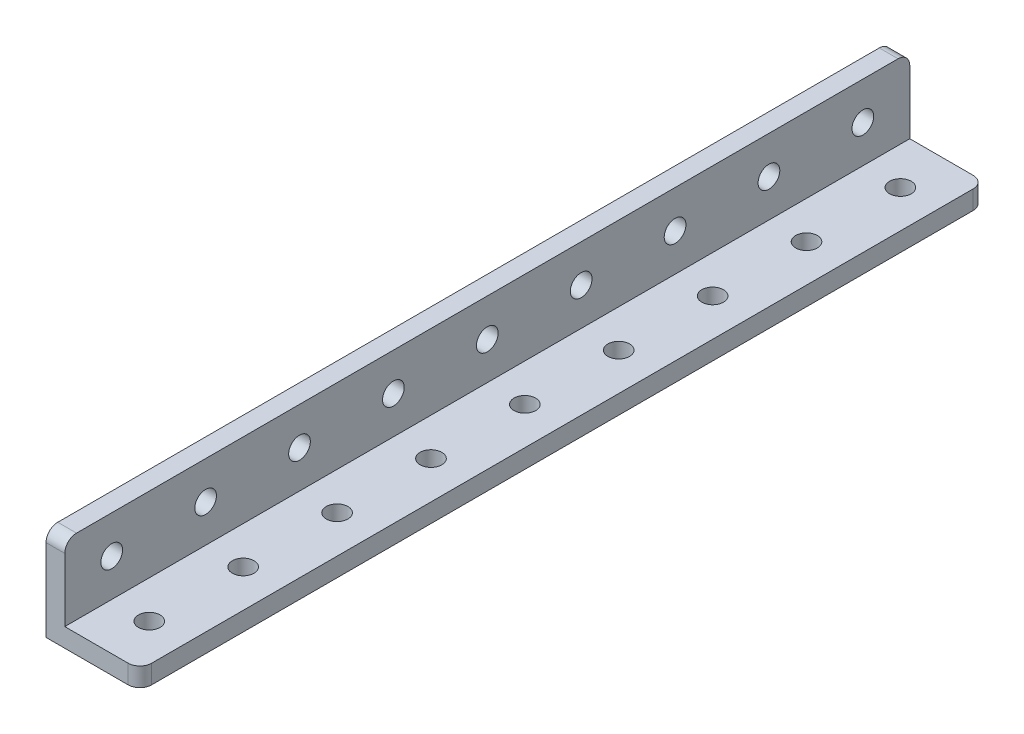
ISO-10303-21;
HEADER;
FILE_DESCRIPTION(('STEP AP214'),'2;1');
FILE_NAME('part.step','',(''),(''),'','','');
FILE_SCHEMA(('AUTOMOTIVE_DESIGN { 1 0 10303 214 1 1 1 1 }'));
ENDSEC;
DATA;
#1=APPLICATION_CONTEXT('core data for automotive mechanical design processes');
#2=APPLICATION_PROTOCOL_DEFINITION('international standard','automotive_design',2000,#1);
#3=PRODUCT_CONTEXT('',#1,'mechanical');
#4=PRODUCT('Part','Part','',(#3));
#5=PRODUCT_RELATED_PRODUCT_CATEGORY('part','',(#4));
#6=PRODUCT_DEFINITION_FORMATION('','',#4);
#7=PRODUCT_DEFINITION_CONTEXT('part definition',#1,'design');
#8=PRODUCT_DEFINITION('design','',#6,#7);
#9=PRODUCT_DEFINITION_SHAPE('','',#8);
#10=(LENGTH_UNIT() NAMED_UNIT(*) SI_UNIT(.MILLI.,.METRE.));
#11=(NAMED_UNIT(*) PLANE_ANGLE_UNIT() SI_UNIT($,.RADIAN.));
#12=(NAMED_UNIT(*) SI_UNIT($,.STERADIAN.) SOLID_ANGLE_UNIT());
#13=UNCERTAINTY_MEASURE_WITH_UNIT(LENGTH_MEASURE(1.E-05),#10,'distance_accuracy_value','');
#14=(GEOMETRIC_REPRESENTATION_CONTEXT(3) GLOBAL_UNCERTAINTY_ASSIGNED_CONTEXT((#13)) GLOBAL_UNIT_ASSIGNED_CONTEXT((#10,
#11,#12)) REPRESENTATION_CONTEXT('',''));
#15=CARTESIAN_POINT('',(0.,0.,0.));
#16=DIRECTION('',(0.,0.,1.));
#17=DIRECTION('',(1.,0.,0.));
#18=AXIS2_PLACEMENT_3D('',#15,#16,#17);
#19=CARTESIAN_POINT('',(14.,36.8576,-142.));
#20=DIRECTION('',(0.,-1.,0.));
#21=DIRECTION('',(0.,0.,-1.));
#22=AXIS2_PLACEMENT_3D('',#19,#20,#21);
#23=CYLINDRICAL_SURFACE('',#22,2.);
#24=CARTESIAN_POINT('',(14.,3.2,-142.));
#25=DIRECTION('',(0.,-1.,0.));
#26=DIRECTION('',(0.,0.,-1.));
#27=AXIS2_PLACEMENT_3D('',#24,#25,#26);
#28=CIRCLE('',#27,2.);
#29=CARTESIAN_POINT('',(16.,3.2,-142.));
#30=VERTEX_POINT('',#29);
#31=CARTESIAN_POINT('',(14.,3.2,-144.));
#32=VERTEX_POINT('',#31);
#33=EDGE_CURVE('E18',#30,#32,#28,.F.);
#34=ORIENTED_EDGE('',*,*,#33,.F.);
#35=DIRECTION('',(0.,1.,0.));
#36=VECTOR('',#35,1.);
#37=CARTESIAN_POINT('',(16.,0.,-142.));
#38=LINE('',#37,#36);
#39=CARTESIAN_POINT('',(16.,0.,-142.));
#40=VERTEX_POINT('',#39);
#41=EDGE_CURVE('E83',#40,#30,#38,.T.);
#42=ORIENTED_EDGE('',*,*,#41,.F.);
#43=CARTESIAN_POINT('',(14.,0.,-142.));
#44=DIRECTION('',(0.,-1.,0.));
#45=DIRECTION('',(0.,0.,-1.));
#46=AXIS2_PLACEMENT_3D('',#43,#44,#45);
#47=CIRCLE('',#46,2.);
#48=CARTESIAN_POINT('',(14.,0.,-144.));
#49=VERTEX_POINT('',#48);
#50=EDGE_CURVE('E224',#49,#40,#47,.T.);
#51=ORIENTED_EDGE('',*,*,#50,.F.);
#52=DIRECTION('',(0.,1.,0.));
#53=VECTOR('',#52,1.);
#54=CARTESIAN_POINT('',(14.,0.,-144.));
#55=LINE('',#54,#53);
#56=EDGE_CURVE('E86',#49,#32,#55,.T.);
#57=ORIENTED_EDGE('',*,*,#56,.T.);
#58=EDGE_LOOP('',(#34,#42,#51,#57));
#59=FACE_BOUND('',#58,.T.);
#60=ADVANCED_FACE('F15',(#59),#23,.T.);
#61=CARTESIAN_POINT('',(16.,0.,0.));
#62=DIRECTION('',(1.,0.,0.));
#63=DIRECTION('',(0.,0.,-1.));
#64=AXIS2_PLACEMENT_3D('',#61,#62,#63);
#65=PLANE('',#64);
#66=DIRECTION('',(0.,1.,0.));
#67=VECTOR('',#66,1.);
#68=CARTESIAN_POINT('',(16.,-20.8576,-2.));
#69=LINE('',#68,#67);
#70=CARTESIAN_POINT('',(16.,0.,-2.));
#71=VERTEX_POINT('',#70);
#72=CARTESIAN_POINT('',(16.,3.2,-2.));
#73=VERTEX_POINT('',#72);
#74=EDGE_CURVE('E92',#71,#73,#69,.T.);
#75=ORIENTED_EDGE('',*,*,#74,.F.);
#76=DIRECTION('',(0.,0.,-1.));
#77=VECTOR('',#76,1.);
#78=CARTESIAN_POINT('',(16.,0.,0.));
#79=LINE('',#78,#77);
#80=EDGE_CURVE('E99',#40,#71,#79,.F.);
#81=ORIENTED_EDGE('',*,*,#80,.F.);
#82=ORIENTED_EDGE('',*,*,#41,.T.);
#83=DIRECTION('',(0.,0.,1.));
#84=VECTOR('',#83,1.);
#85=CARTESIAN_POINT('',(16.,3.2,0.));
#86=LINE('',#85,#84);
#87=EDGE_CURVE('E96',#73,#30,#86,.F.);
#88=ORIENTED_EDGE('',*,*,#87,.F.);
#89=EDGE_LOOP('',(#75,#81,#82,#88));
#90=FACE_BOUND('',#89,.T.);
#91=ADVANCED_FACE('F95',(#90),#65,.T.);
#92=CARTESIAN_POINT('',(9.6,3.2,-8.));
#93=DIRECTION('',(0.,-1.,0.));
#94=DIRECTION('',(0.,0.,-1.));
#95=AXIS2_PLACEMENT_3D('',#92,#93,#94);
#96=CYLINDRICAL_SURFACE('',#95,1.85);
#97=CARTESIAN_POINT('',(9.6,3.2,-8.));
#98=DIRECTION('',(0.,-1.,0.));
#99=DIRECTION('',(0.,0.,-1.));
#100=AXIS2_PLACEMENT_3D('',#97,#98,#99);
#101=CIRCLE('',#100,1.85);
#102=CARTESIAN_POINT('',(9.6,3.2,-9.85));
#103=VERTEX_POINT('',#102);
#104=EDGE_CURVE('E104',#103,#103,#101,.T.);
#105=ORIENTED_EDGE('',*,*,#104,.F.);
#106=EDGE_LOOP('',(#105));
#107=FACE_BOUND('',#106,.T.);
#108=CARTESIAN_POINT('',(9.6,0.,-8.));
#109=DIRECTION('',(0.,-1.,0.));
#110=DIRECTION('',(0.,0.,-1.));
#111=AXIS2_PLACEMENT_3D('',#108,#109,#110);
#112=CIRCLE('',#111,1.85);
#113=CARTESIAN_POINT('',(9.6,0.,-9.85));
#114=VERTEX_POINT('',#113);
#115=EDGE_CURVE('E218',#114,#114,#112,.F.);
#116=ORIENTED_EDGE('',*,*,#115,.F.);
#117=EDGE_LOOP('',(#116));
#118=FACE_BOUND('',#117,.T.);
#119=ADVANCED_FACE('F259',(#107,#118),#96,.F.);
#120=CARTESIAN_POINT('',(9.6,3.2,-24.));
#121=DIRECTION('',(0.,-1.,0.));
#122=DIRECTION('',(0.,0.,-1.));
#123=AXIS2_PLACEMENT_3D('',#120,#121,#122);
#124=CYLINDRICAL_SURFACE('',#123,1.85);
#125=CARTESIAN_POINT('',(9.6,3.2,-24.));
#126=DIRECTION('',(0.,-1.,0.));
#127=DIRECTION('',(0.,0.,-1.));
#128=AXIS2_PLACEMENT_3D('',#125,#126,#127);
#129=CIRCLE('',#128,1.85);
#130=CARTESIAN_POINT('',(9.6,3.2,-25.85));
#131=VERTEX_POINT('',#130);
#132=EDGE_CURVE('E107',#131,#131,#129,.T.);
#133=ORIENTED_EDGE('',*,*,#132,.F.);
#134=EDGE_LOOP('',(#133));
#135=FACE_BOUND('',#134,.T.);
#136=CARTESIAN_POINT('',(9.6,0.,-24.));
#137=DIRECTION('',(0.,-1.,0.));
#138=DIRECTION('',(0.,0.,-1.));
#139=AXIS2_PLACEMENT_3D('',#136,#137,#138);
#140=CIRCLE('',#139,1.85);
#141=CARTESIAN_POINT('',(9.6,0.,-25.85));
#142=VERTEX_POINT('',#141);
#143=EDGE_CURVE('E215',#142,#142,#140,.F.);
#144=ORIENTED_EDGE('',*,*,#143,.F.);
#145=EDGE_LOOP('',(#144));
#146=FACE_BOUND('',#145,.T.);
#147=ADVANCED_FACE('F255',(#135,#146),#124,.F.);
#148=CARTESIAN_POINT('',(9.6,3.2,-40.));
#149=DIRECTION('',(0.,-1.,0.));
#150=DIRECTION('',(0.,0.,-1.));
#151=AXIS2_PLACEMENT_3D('',#148,#149,#150);
#152=CYLINDRICAL_SURFACE('',#151,1.85);
#153=CARTESIAN_POINT('',(9.6,3.2,-40.));
#154=DIRECTION('',(0.,-1.,0.));
#155=DIRECTION('',(0.,0.,-1.));
#156=AXIS2_PLACEMENT_3D('',#153,#154,#155);
#157=CIRCLE('',#156,1.85);
#158=CARTESIAN_POINT('',(9.6,3.2,-41.85));
#159=VERTEX_POINT('',#158);
#160=EDGE_CURVE('E247',#159,#159,#157,.T.);
#161=ORIENTED_EDGE('',*,*,#160,.F.);
#162=EDGE_LOOP('',(#161));
#163=FACE_BOUND('',#162,.T.);
#164=CARTESIAN_POINT('',(9.6,0.,-40.));
#165=DIRECTION('',(0.,-1.,0.));
#166=DIRECTION('',(0.,0.,-1.));
#167=AXIS2_PLACEMENT_3D('',#164,#165,#166);
#168=CIRCLE('',#167,1.85);
#169=CARTESIAN_POINT('',(9.6,0.,-41.85));
#170=VERTEX_POINT('',#169);
#171=EDGE_CURVE('E212',#170,#170,#168,.F.);
#172=ORIENTED_EDGE('',*,*,#171,.F.);
#173=EDGE_LOOP('',(#172));
#174=FACE_BOUND('',#173,.T.);
#175=ADVANCED_FACE('F258',(#163,#174),#152,.F.);
#176=CARTESIAN_POINT('',(9.6,3.2,-56.));
#177=DIRECTION('',(0.,-1.,0.));
#178=DIRECTION('',(0.,0.,-1.));
#179=AXIS2_PLACEMENT_3D('',#176,#177,#178);
#180=CYLINDRICAL_SURFACE('',#179,1.85);
#181=CARTESIAN_POINT('',(9.6,3.2,-56.));
#182=DIRECTION('',(0.,-1.,0.));
#183=DIRECTION('',(0.,0.,-1.));
#184=AXIS2_PLACEMENT_3D('',#181,#182,#183);
#185=CIRCLE('',#184,1.85);
#186=CARTESIAN_POINT('',(9.6,3.2,-57.85));
#187=VERTEX_POINT('',#186);
#188=EDGE_CURVE('E244',#187,#187,#185,.T.);
#189=ORIENTED_EDGE('',*,*,#188,.F.);
#190=EDGE_LOOP('',(#189));
#191=FACE_BOUND('',#190,.T.);
#192=CARTESIAN_POINT('',(9.6,0.,-56.));
#193=DIRECTION('',(0.,-1.,0.));
#194=DIRECTION('',(0.,0.,-1.));
#195=AXIS2_PLACEMENT_3D('',#192,#193,#194);
#196=CIRCLE('',#195,1.85);
#197=CARTESIAN_POINT('',(9.6,0.,-57.85));
#198=VERTEX_POINT('',#197);
#199=EDGE_CURVE('E209',#198,#198,#196,.F.);
#200=ORIENTED_EDGE('',*,*,#199,.F.);
#201=EDGE_LOOP('',(#200));
#202=FACE_BOUND('',#201,.T.);
#203=ADVANCED_FACE('F561',(#191,#202),#180,.F.);
#204=CARTESIAN_POINT('',(9.6,3.2,-72.));
#205=DIRECTION('',(0.,-1.,0.));
#206=DIRECTION('',(0.,0.,-1.));
#207=AXIS2_PLACEMENT_3D('',#204,#205,#206);
#208=CYLINDRICAL_SURFACE('',#207,1.85);
#209=CARTESIAN_POINT('',(9.6,3.2,-72.));
#210=DIRECTION('',(0.,-1.,0.));
#211=DIRECTION('',(0.,0.,-1.));
#212=AXIS2_PLACEMENT_3D('',#209,#210,#211);
#213=CIRCLE('',#212,1.85);
#214=CARTESIAN_POINT('',(9.6,3.2,-73.85));
#215=VERTEX_POINT('',#214);
#216=EDGE_CURVE('E241',#215,#215,#213,.T.);
#217=ORIENTED_EDGE('',*,*,#216,.F.);
#218=EDGE_LOOP('',(#217));
#219=FACE_BOUND('',#218,.T.);
#220=CARTESIAN_POINT('',(9.6,0.,-72.));
#221=DIRECTION('',(0.,-1.,0.));
#222=DIRECTION('',(0.,0.,-1.));
#223=AXIS2_PLACEMENT_3D('',#220,#221,#222);
#224=CIRCLE('',#223,1.85);
#225=CARTESIAN_POINT('',(9.6,0.,-73.85));
#226=VERTEX_POINT('',#225);
#227=EDGE_CURVE('E206',#226,#226,#224,.F.);
#228=ORIENTED_EDGE('',*,*,#227,.F.);
#229=EDGE_LOOP('',(#228));
#230=FACE_BOUND('',#229,.T.);
#231=ADVANCED_FACE('F552',(#219,#230),#208,.F.);
#232=CARTESIAN_POINT('',(9.6,3.2,-88.));
#233=DIRECTION('',(0.,-1.,0.));
#234=DIRECTION('',(0.,0.,-1.));
#235=AXIS2_PLACEMENT_3D('',#232,#233,#234);
#236=CYLINDRICAL_SURFACE('',#235,1.85);
#237=CARTESIAN_POINT('',(9.6,3.2,-88.));
#238=DIRECTION('',(0.,-1.,0.));
#239=DIRECTION('',(0.,0.,-1.));
#240=AXIS2_PLACEMENT_3D('',#237,#238,#239);
#241=CIRCLE('',#240,1.85);
#242=CARTESIAN_POINT('',(9.6,3.2,-89.85));
#243=VERTEX_POINT('',#242);
#244=EDGE_CURVE('E238',#243,#243,#241,.T.);
#245=ORIENTED_EDGE('',*,*,#244,.F.);
#246=EDGE_LOOP('',(#245));
#247=FACE_BOUND('',#246,.T.);
#248=CARTESIAN_POINT('',(9.6,0.,-88.));
#249=DIRECTION('',(0.,-1.,0.));
#250=DIRECTION('',(0.,0.,-1.));
#251=AXIS2_PLACEMENT_3D('',#248,#249,#250);
#252=CIRCLE('',#251,1.85);
#253=CARTESIAN_POINT('',(9.6,0.,-89.85));
#254=VERTEX_POINT('',#253);
#255=EDGE_CURVE('E203',#254,#254,#252,.F.);
#256=ORIENTED_EDGE('',*,*,#255,.F.);
#257=EDGE_LOOP('',(#256));
#258=FACE_BOUND('',#257,.T.);
#259=ADVANCED_FACE('F543',(#247,#258),#236,.F.);
#260=CARTESIAN_POINT('',(9.6,3.2,-104.));
#261=DIRECTION('',(0.,-1.,0.));
#262=DIRECTION('',(0.,0.,-1.));
#263=AXIS2_PLACEMENT_3D('',#260,#261,#262);
#264=CYLINDRICAL_SURFACE('',#263,1.85);
#265=CARTESIAN_POINT('',(9.6,3.2,-104.));
#266=DIRECTION('',(0.,-1.,0.));
#267=DIRECTION('',(0.,0.,-1.));
#268=AXIS2_PLACEMENT_3D('',#265,#266,#267);
#269=CIRCLE('',#268,1.85);
#270=CARTESIAN_POINT('',(9.6,3.2,-105.85));
#271=VERTEX_POINT('',#270);
#272=EDGE_CURVE('E235',#271,#271,#269,.T.);
#273=ORIENTED_EDGE('',*,*,#272,.F.);
#274=EDGE_LOOP('',(#273));
#275=FACE_BOUND('',#274,.T.);
#276=CARTESIAN_POINT('',(9.6,0.,-104.));
#277=DIRECTION('',(0.,-1.,0.));
#278=DIRECTION('',(0.,0.,-1.));
#279=AXIS2_PLACEMENT_3D('',#276,#277,#278);
#280=CIRCLE('',#279,1.85);
#281=CARTESIAN_POINT('',(9.6,0.,-105.85));
#282=VERTEX_POINT('',#281);
#283=EDGE_CURVE('E200',#282,#282,#280,.F.);
#284=ORIENTED_EDGE('',*,*,#283,.F.);
#285=EDGE_LOOP('',(#284));
#286=FACE_BOUND('',#285,.T.);
#287=ADVANCED_FACE('F534',(#275,#286),#264,.F.);
#288=CARTESIAN_POINT('',(9.6,3.2,-120.));
#289=DIRECTION('',(0.,-1.,0.));
#290=DIRECTION('',(0.,0.,-1.));
#291=AXIS2_PLACEMENT_3D('',#288,#289,#290);
#292=CYLINDRICAL_SURFACE('',#291,1.85);
#293=CARTESIAN_POINT('',(9.6,3.2,-120.));
#294=DIRECTION('',(0.,-1.,0.));
#295=DIRECTION('',(0.,0.,-1.));
#296=AXIS2_PLACEMENT_3D('',#293,#294,#295);
#297=CIRCLE('',#296,1.85);
#298=CARTESIAN_POINT('',(9.6,3.2,-121.85));
#299=VERTEX_POINT('',#298);
#300=EDGE_CURVE('E232',#299,#299,#297,.T.);
#301=ORIENTED_EDGE('',*,*,#300,.F.);
#302=EDGE_LOOP('',(#301));
#303=FACE_BOUND('',#302,.T.);
#304=CARTESIAN_POINT('',(9.6,0.,-120.));
#305=DIRECTION('',(0.,-1.,0.));
#306=DIRECTION('',(0.,0.,-1.));
#307=AXIS2_PLACEMENT_3D('',#304,#305,#306);
#308=CIRCLE('',#307,1.85);
#309=CARTESIAN_POINT('',(9.6,0.,-121.85));
#310=VERTEX_POINT('',#309);
#311=EDGE_CURVE('E197',#310,#310,#308,.F.);
#312=ORIENTED_EDGE('',*,*,#311,.F.);
#313=EDGE_LOOP('',(#312));
#314=FACE_BOUND('',#313,.T.);
#315=ADVANCED_FACE('F525',(#303,#314),#292,.F.);
#316=CARTESIAN_POINT('',(9.6,3.2,-136.));
#317=DIRECTION('',(0.,-1.,0.));
#318=DIRECTION('',(0.,0.,-1.));
#319=AXIS2_PLACEMENT_3D('',#316,#317,#318);
#320=CYLINDRICAL_SURFACE('',#319,1.85);
#321=CARTESIAN_POINT('',(9.6,3.2,-136.));
#322=DIRECTION('',(0.,-1.,0.));
#323=DIRECTION('',(0.,0.,-1.));
#324=AXIS2_PLACEMENT_3D('',#321,#322,#323);
#325=CIRCLE('',#324,1.85);
#326=CARTESIAN_POINT('',(9.6,3.2,-137.85));
#327=VERTEX_POINT('',#326);
#328=EDGE_CURVE('E229',#327,#327,#325,.T.);
#329=ORIENTED_EDGE('',*,*,#328,.F.);
#330=EDGE_LOOP('',(#329));
#331=FACE_BOUND('',#330,.T.);
#332=CARTESIAN_POINT('',(9.6,0.,-136.));
#333=DIRECTION('',(0.,-1.,0.));
#334=DIRECTION('',(0.,0.,-1.));
#335=AXIS2_PLACEMENT_3D('',#332,#333,#334);
#336=CIRCLE('',#335,1.85);
#337=CARTESIAN_POINT('',(9.6,0.,-137.85));
#338=VERTEX_POINT('',#337);
#339=EDGE_CURVE('E194',#338,#338,#336,.F.);
#340=ORIENTED_EDGE('',*,*,#339,.F.);
#341=EDGE_LOOP('',(#340));
#342=FACE_BOUND('',#341,.T.);
#343=ADVANCED_FACE('F516',(#331,#342),#320,.F.);
#344=CARTESIAN_POINT('',(14.,-20.8576,-2.));
#345=DIRECTION('',(0.,1.,0.));
#346=DIRECTION('',(0.,0.,1.));
#347=AXIS2_PLACEMENT_3D('',#344,#345,#346);
#348=CYLINDRICAL_SURFACE('',#347,2.);
#349=CARTESIAN_POINT('',(14.,0.,-2.));
#350=DIRECTION('',(0.,1.,0.));
#351=DIRECTION('',(0.,0.,1.));
#352=AXIS2_PLACEMENT_3D('',#349,#350,#351);
#353=CIRCLE('',#352,2.);
#354=CARTESIAN_POINT('',(14.,0.,0.));
#355=VERTEX_POINT('',#354);
#356=EDGE_CURVE('E222',#71,#355,#353,.F.);
#357=ORIENTED_EDGE('',*,*,#356,.F.);
#358=ORIENTED_EDGE('',*,*,#74,.T.);
#359=CARTESIAN_POINT('',(14.,3.2,-2.));
#360=DIRECTION('',(0.,1.,0.));
#361=DIRECTION('',(0.,0.,1.));
#362=AXIS2_PLACEMENT_3D('',#359,#360,#361);
#363=CIRCLE('',#362,2.);
#364=CARTESIAN_POINT('',(14.,3.2,0.));
#365=VERTEX_POINT('',#364);
#366=EDGE_CURVE('E91',#365,#73,#363,.T.);
#367=ORIENTED_EDGE('',*,*,#366,.F.);
#368=DIRECTION('',(0.,1.,0.));
#369=VECTOR('',#368,1.);
#370=CARTESIAN_POINT('',(14.,0.,0.));
#371=LINE('',#370,#369);
#372=EDGE_CURVE('E113',#355,#365,#371,.T.);
#373=ORIENTED_EDGE('',*,*,#372,.F.);
#374=EDGE_LOOP('',(#357,#358,#367,#373));
#375=FACE_BOUND('',#374,.T.);
#376=ADVANCED_FACE('F507',(#375),#348,.T.);
#377=CARTESIAN_POINT('',(16.,3.2,0.));
#378=DIRECTION('',(0.,1.,0.));
#379=DIRECTION('',(0.,0.,1.));
#380=AXIS2_PLACEMENT_3D('',#377,#378,#379);
#381=PLANE('',#380);
#382=ORIENTED_EDGE('',*,*,#328,.T.);
#383=EDGE_LOOP('',(#382));
#384=FACE_BOUND('',#383,.T.);
#385=ORIENTED_EDGE('',*,*,#300,.T.);
#386=EDGE_LOOP('',(#385));
#387=FACE_BOUND('',#386,.T.);
#388=ORIENTED_EDGE('',*,*,#272,.T.);
#389=EDGE_LOOP('',(#388));
#390=FACE_BOUND('',#389,.T.);
#391=ORIENTED_EDGE('',*,*,#244,.T.);
#392=EDGE_LOOP('',(#391));
#393=FACE_BOUND('',#392,.T.);
#394=ORIENTED_EDGE('',*,*,#216,.T.);
#395=EDGE_LOOP('',(#394));
#396=FACE_BOUND('',#395,.T.);
#397=ORIENTED_EDGE('',*,*,#188,.T.);
#398=EDGE_LOOP('',(#397));
#399=FACE_BOUND('',#398,.T.);
#400=ORIENTED_EDGE('',*,*,#160,.T.);
#401=EDGE_LOOP('',(#400));
#402=FACE_BOUND('',#401,.T.);
#403=ORIENTED_EDGE('',*,*,#132,.T.);
#404=EDGE_LOOP('',(#403));
#405=FACE_BOUND('',#404,.T.);
#406=ORIENTED_EDGE('',*,*,#104,.T.);
#407=EDGE_LOOP('',(#406));
#408=FACE_BOUND('',#407,.T.);
#409=ORIENTED_EDGE('',*,*,#366,.T.);
#410=ORIENTED_EDGE('',*,*,#87,.T.);
#411=ORIENTED_EDGE('',*,*,#33,.T.);
#412=DIRECTION('',(1.,0.,0.));
#413=VECTOR('',#412,1.);
#414=CARTESIAN_POINT('',(0.,3.2,-144.));
#415=LINE('',#414,#413);
#416=CARTESIAN_POINT('',(3.2,3.2,-144.));
#417=VERTEX_POINT('',#416);
#418=EDGE_CURVE('E119',#32,#417,#415,.F.);
#419=ORIENTED_EDGE('',*,*,#418,.T.);
#420=DIRECTION('',(0.,0.,-1.));
#421=VECTOR('',#420,1.);
#422=CARTESIAN_POINT('',(3.2,3.2,0.));
#423=LINE('',#422,#421);
#424=CARTESIAN_POINT('',(3.2,3.2,0.));
#425=VERTEX_POINT('',#424);
#426=EDGE_CURVE('E228',#425,#417,#423,.T.);
#427=ORIENTED_EDGE('',*,*,#426,.F.);
#428=DIRECTION('',(1.,0.,0.));
#429=VECTOR('',#428,1.);
#430=CARTESIAN_POINT('',(0.,3.2,0.));
#431=LINE('',#430,#429);
#432=EDGE_CURVE('E116',#365,#425,#431,.F.);
#433=ORIENTED_EDGE('',*,*,#432,.F.);
#434=EDGE_LOOP('',(#409,#410,#411,#419,#427,#433));
#435=FACE_BOUND('',#434,.T.);
#436=ADVANCED_FACE('F102',(#384,#387,#390,#393,#396,#399,#402,#405,#408,#435),#381,.T.);
#437=CARTESIAN_POINT('',(3.2,3.2,0.));
#438=DIRECTION('',(1.,0.,0.));
#439=DIRECTION('',(0.,0.,-1.));
#440=AXIS2_PLACEMENT_3D('',#437,#438,#439);
#441=PLANE('',#440);
#442=CARTESIAN_POINT('',(3.2,9.6,-136.));
#443=DIRECTION('',(-1.,0.,0.));
#444=DIRECTION('',(0.,0.,1.));
#445=AXIS2_PLACEMENT_3D('',#442,#443,#444);
#446=CIRCLE('',#445,1.85);
#447=CARTESIAN_POINT('',(3.2,9.6,-134.15));
#448=VERTEX_POINT('',#447);
#449=EDGE_CURVE('E162',#448,#448,#446,.T.);
#450=ORIENTED_EDGE('',*,*,#449,.T.);
#451=EDGE_LOOP('',(#450));
#452=FACE_BOUND('',#451,.T.);
#453=CARTESIAN_POINT('',(3.2,9.6,-120.));
#454=DIRECTION('',(-1.,0.,0.));
#455=DIRECTION('',(0.,0.,1.));
#456=AXIS2_PLACEMENT_3D('',#453,#454,#455);
#457=CIRCLE('',#456,1.85);
#458=CARTESIAN_POINT('',(3.2,9.6,-118.15));
#459=VERTEX_POINT('',#458);
#460=EDGE_CURVE('E165',#459,#459,#457,.T.);
#461=ORIENTED_EDGE('',*,*,#460,.T.);
#462=EDGE_LOOP('',(#461));
#463=FACE_BOUND('',#462,.T.);
#464=CARTESIAN_POINT('',(3.2,9.6,-104.));
#465=DIRECTION('',(-1.,0.,0.));
#466=DIRECTION('',(0.,0.,1.));
#467=AXIS2_PLACEMENT_3D('',#464,#465,#466);
#468=CIRCLE('',#467,1.85);
#469=CARTESIAN_POINT('',(3.2,9.6,-102.15));
#470=VERTEX_POINT('',#469);
#471=EDGE_CURVE('E168',#470,#470,#468,.T.);
#472=ORIENTED_EDGE('',*,*,#471,.T.);
#473=EDGE_LOOP('',(#472));
#474=FACE_BOUND('',#473,.T.);
#475=CARTESIAN_POINT('',(3.2,9.6,-88.));
#476=DIRECTION('',(-1.,0.,0.));
#477=DIRECTION('',(0.,0.,1.));
#478=AXIS2_PLACEMENT_3D('',#475,#476,#477);
#479=CIRCLE('',#478,1.85);
#480=CARTESIAN_POINT('',(3.2,9.6,-86.15));
#481=VERTEX_POINT('',#480);
#482=EDGE_CURVE('E171',#481,#481,#479,.T.);
#483=ORIENTED_EDGE('',*,*,#482,.T.);
#484=EDGE_LOOP('',(#483));
#485=FACE_BOUND('',#484,.T.);
#486=CARTESIAN_POINT('',(3.2,9.6,-72.));
#487=DIRECTION('',(-1.,0.,0.));
#488=DIRECTION('',(0.,0.,1.));
#489=AXIS2_PLACEMENT_3D('',#486,#487,#488);
#490=CIRCLE('',#489,1.85);
#491=CARTESIAN_POINT('',(3.2,9.6,-70.15));
#492=VERTEX_POINT('',#491);
#493=EDGE_CURVE('E174',#492,#492,#490,.T.);
#494=ORIENTED_EDGE('',*,*,#493,.T.);
#495=EDGE_LOOP('',(#494));
#496=FACE_BOUND('',#495,.T.);
#497=CARTESIAN_POINT('',(3.2,9.6,-56.));
#498=DIRECTION('',(-1.,0.,0.));
#499=DIRECTION('',(0.,0.,1.));
#500=AXIS2_PLACEMENT_3D('',#497,#498,#499);
#501=CIRCLE('',#500,1.85);
#502=CARTESIAN_POINT('',(3.2,9.6,-54.15));
#503=VERTEX_POINT('',#502);
#504=EDGE_CURVE('E177',#503,#503,#501,.T.);
#505=ORIENTED_EDGE('',*,*,#504,.T.);
#506=EDGE_LOOP('',(#505));
#507=FACE_BOUND('',#506,.T.);
#508=CARTESIAN_POINT('',(3.2,9.6,-40.));
#509=DIRECTION('',(-1.,0.,0.));
#510=DIRECTION('',(0.,0.,1.));
#511=AXIS2_PLACEMENT_3D('',#508,#509,#510);
#512=CIRCLE('',#511,1.85);
#513=CARTESIAN_POINT('',(3.2,9.6,-38.15));
#514=VERTEX_POINT('',#513);
#515=EDGE_CURVE('E180',#514,#514,#512,.T.);
#516=ORIENTED_EDGE('',*,*,#515,.T.);
#517=EDGE_LOOP('',(#516));
#518=FACE_BOUND('',#517,.T.);
#519=CARTESIAN_POINT('',(3.2,9.6,-24.));
#520=DIRECTION('',(-1.,0.,0.));
#521=DIRECTION('',(0.,0.,1.));
#522=AXIS2_PLACEMENT_3D('',#519,#520,#521);
#523=CIRCLE('',#522,1.85);
#524=CARTESIAN_POINT('',(3.2,9.6,-22.15));
#525=VERTEX_POINT('',#524);
#526=EDGE_CURVE('E183',#525,#525,#523,.T.);
#527=ORIENTED_EDGE('',*,*,#526,.T.);
#528=EDGE_LOOP('',(#527));
#529=FACE_BOUND('',#528,.T.);
#530=CARTESIAN_POINT('',(3.2,9.6,-8.));
#531=DIRECTION('',(-1.,0.,0.));
#532=DIRECTION('',(0.,0.,1.));
#533=AXIS2_PLACEMENT_3D('',#530,#531,#532);
#534=CIRCLE('',#533,1.85);
#535=CARTESIAN_POINT('',(3.2,9.6,-6.15));
#536=VERTEX_POINT('',#535);
#537=EDGE_CURVE('E186',#536,#536,#534,.T.);
#538=ORIENTED_EDGE('',*,*,#537,.T.);
#539=EDGE_LOOP('',(#538));
#540=FACE_BOUND('',#539,.T.);
#541=ORIENTED_EDGE('',*,*,#426,.T.);
#542=DIRECTION('',(0.,1.,0.));
#543=VECTOR('',#542,1.);
#544=CARTESIAN_POINT('',(3.2,0.,-144.));
#545=LINE('',#544,#543);
#546=CARTESIAN_POINT('',(3.2,14.,-144.));
#547=VERTEX_POINT('',#546);
#548=EDGE_CURVE('E122',#417,#547,#545,.T.);
#549=ORIENTED_EDGE('',*,*,#548,.T.);
#550=CARTESIAN_POINT('',(3.2,14.,-142.));
#551=DIRECTION('',(1.,0.,0.));
#552=DIRECTION('',(0.,0.,-1.));
#553=AXIS2_PLACEMENT_3D('',#550,#551,#552);
#554=CIRCLE('',#553,2.);
#555=CARTESIAN_POINT('',(3.2,16.,-142.));
#556=VERTEX_POINT('',#555);
#557=EDGE_CURVE('E120',#556,#547,#554,.F.);
#558=ORIENTED_EDGE('',*,*,#557,.F.);
#559=DIRECTION('',(0.,0.,1.));
#560=VECTOR('',#559,1.);
#561=CARTESIAN_POINT('',(3.2,16.,0.));
#562=LINE('',#561,#560);
#563=CARTESIAN_POINT('',(3.2,16.,-2.));
#564=VERTEX_POINT('',#563);
#565=EDGE_CURVE('E189',#564,#556,#562,.F.);
#566=ORIENTED_EDGE('',*,*,#565,.F.);
#567=CARTESIAN_POINT('',(3.2,14.,-2.));
#568=DIRECTION('',(-1.,0.,0.));
#569=DIRECTION('',(0.,0.,1.));
#570=AXIS2_PLACEMENT_3D('',#567,#568,#569);
#571=CIRCLE('',#570,2.);
#572=CARTESIAN_POINT('',(3.2,14.,0.));
#573=VERTEX_POINT('',#572);
#574=EDGE_CURVE('E190',#573,#564,#571,.T.);
#575=ORIENTED_EDGE('',*,*,#574,.F.);
#576=DIRECTION('',(0.,1.,0.));
#577=VECTOR('',#576,1.);
#578=CARTESIAN_POINT('',(3.2,0.,0.));
#579=LINE('',#578,#577);
#580=EDGE_CURVE('E302',#425,#573,#579,.T.);
#581=ORIENTED_EDGE('',*,*,#580,.F.);
#582=EDGE_LOOP('',(#541,#549,#558,#566,#575,#581));
#583=FACE_BOUND('',#582,.T.);
#584=ADVANCED_FACE('F329',(#452,#463,#474,#485,#496,#507,#518,#529,#540,#583),#441,.T.);
#585=CARTESIAN_POINT('',(-20.8576,14.,-142.));
#586=DIRECTION('',(1.,0.,0.));
#587=DIRECTION('',(0.,0.,-1.));
#588=AXIS2_PLACEMENT_3D('',#585,#586,#587);
#589=CYLINDRICAL_SURFACE('',#588,2.);
#590=CARTESIAN_POINT('',(0.,14.,-142.));
#591=DIRECTION('',(1.,0.,0.));
#592=DIRECTION('',(0.,0.,-1.));
#593=AXIS2_PLACEMENT_3D('',#590,#591,#592);
#594=CIRCLE('',#593,2.);
#595=CARTESIAN_POINT('',(0.,16.,-142.));
#596=VERTEX_POINT('',#595);
#597=CARTESIAN_POINT('',(0.,14.,-144.));
#598=VERTEX_POINT('',#597);
#599=EDGE_CURVE('E158',#596,#598,#594,.F.);
#600=ORIENTED_EDGE('',*,*,#599,.F.);
#601=DIRECTION('',(1.,0.,0.));
#602=VECTOR('',#601,1.);
#603=CARTESIAN_POINT('',(3.2,16.,-142.));
#604=LINE('',#603,#602);
#605=EDGE_CURVE('E192',#556,#596,#604,.F.);
#606=ORIENTED_EDGE('',*,*,#605,.F.);
#607=ORIENTED_EDGE('',*,*,#557,.T.);
#608=DIRECTION('',(1.,0.,0.));
#609=VECTOR('',#608,1.);
#610=CARTESIAN_POINT('',(0.,14.,-144.));
#611=LINE('',#610,#609);
#612=EDGE_CURVE('E124',#547,#598,#611,.F.);
#613=ORIENTED_EDGE('',*,*,#612,.T.);
#614=EDGE_LOOP('',(#600,#606,#607,#613));
#615=FACE_BOUND('',#614,.T.);
#616=ADVANCED_FACE('F338',(#615),#589,.T.);
#617=CARTESIAN_POINT('',(0.,0.,-144.));
#618=DIRECTION('',(0.,0.,1.));
#619=DIRECTION('',(1.,0.,0.));
#620=AXIS2_PLACEMENT_3D('',#617,#618,#619);
#621=PLANE('',#620);
#622=ORIENTED_EDGE('',*,*,#548,.F.);
#623=ORIENTED_EDGE('',*,*,#418,.F.);
#624=ORIENTED_EDGE('',*,*,#56,.F.);
#625=DIRECTION('',(1.,0.,0.));
#626=VECTOR('',#625,1.);
#627=CARTESIAN_POINT('',(0.,0.,-144.));
#628=LINE('',#627,#626);
#629=CARTESIAN_POINT('',(0.,0.,-144.));
#630=VERTEX_POINT('',#629);
#631=EDGE_CURVE('E221',#630,#49,#628,.T.);
#632=ORIENTED_EDGE('',*,*,#631,.F.);
#633=DIRECTION('',(0.,1.,0.));
#634=VECTOR('',#633,1.);
#635=CARTESIAN_POINT('',(0.,16.,-144.));
#636=LINE('',#635,#634);
#637=EDGE_CURVE('E161',#598,#630,#636,.F.);
#638=ORIENTED_EDGE('',*,*,#637,.F.);
#639=ORIENTED_EDGE('',*,*,#612,.F.);
#640=EDGE_LOOP('',(#622,#623,#624,#632,#638,#639));
#641=FACE_BOUND('',#640,.T.);
#642=ADVANCED_FACE('F267',(#641),#621,.F.);
#643=CARTESIAN_POINT('',(0.,0.,0.));
#644=DIRECTION('',(0.,-1.,0.));
#645=DIRECTION('',(0.,0.,-1.));
#646=AXIS2_PLACEMENT_3D('',#643,#644,#645);
#647=PLANE('',#646);
#648=ORIENTED_EDGE('',*,*,#339,.T.);
#649=EDGE_LOOP('',(#648));
#650=FACE_BOUND('',#649,.T.);
#651=ORIENTED_EDGE('',*,*,#311,.T.);
#652=EDGE_LOOP('',(#651));
#653=FACE_BOUND('',#652,.T.);
#654=ORIENTED_EDGE('',*,*,#283,.T.);
#655=EDGE_LOOP('',(#654));
#656=FACE_BOUND('',#655,.T.);
#657=ORIENTED_EDGE('',*,*,#255,.T.);
#658=EDGE_LOOP('',(#657));
#659=FACE_BOUND('',#658,.T.);
#660=ORIENTED_EDGE('',*,*,#227,.T.);
#661=EDGE_LOOP('',(#660));
#662=FACE_BOUND('',#661,.T.);
#663=ORIENTED_EDGE('',*,*,#199,.T.);
#664=EDGE_LOOP('',(#663));
#665=FACE_BOUND('',#664,.T.);
#666=ORIENTED_EDGE('',*,*,#171,.T.);
#667=EDGE_LOOP('',(#666));
#668=FACE_BOUND('',#667,.T.);
#669=ORIENTED_EDGE('',*,*,#143,.T.);
#670=EDGE_LOOP('',(#669));
#671=FACE_BOUND('',#670,.T.);
#672=ORIENTED_EDGE('',*,*,#115,.T.);
#673=EDGE_LOOP('',(#672));
#674=FACE_BOUND('',#673,.T.);
#675=DIRECTION('',(0.,0.,1.));
#676=VECTOR('',#675,1.);
#677=CARTESIAN_POINT('',(0.,0.,0.));
#678=LINE('',#677,#676);
#679=CARTESIAN_POINT('',(0.,0.,0.));
#680=VERTEX_POINT('',#679);
#681=EDGE_CURVE('E276',#630,#680,#678,.T.);
#682=ORIENTED_EDGE('',*,*,#681,.F.);
#683=ORIENTED_EDGE('',*,*,#631,.T.);
#684=ORIENTED_EDGE('',*,*,#50,.T.);
#685=ORIENTED_EDGE('',*,*,#80,.T.);
#686=ORIENTED_EDGE('',*,*,#356,.T.);
#687=DIRECTION('',(1.,0.,0.));
#688=VECTOR('',#687,1.);
#689=CARTESIAN_POINT('',(0.,0.,0.));
#690=LINE('',#689,#688);
#691=EDGE_CURVE('E117',#680,#355,#690,.T.);
#692=ORIENTED_EDGE('',*,*,#691,.F.);
#693=EDGE_LOOP('',(#682,#683,#684,#685,#686,#692));
#694=FACE_BOUND('',#693,.T.);
#695=ADVANCED_FACE('F263',(#650,#653,#656,#659,#662,#665,#668,#671,#674,#694),#647,.T.);
#696=CARTESIAN_POINT('',(0.,0.,0.));
#697=DIRECTION('',(0.,0.,1.));
#698=DIRECTION('',(1.,0.,0.));
#699=AXIS2_PLACEMENT_3D('',#696,#697,#698);
#700=PLANE('',#699);
#701=ORIENTED_EDGE('',*,*,#432,.T.);
#702=ORIENTED_EDGE('',*,*,#580,.T.);
#703=DIRECTION('',(-1.,0.,0.));
#704=VECTOR('',#703,1.);
#705=CARTESIAN_POINT('',(36.8576,14.,0.));
#706=LINE('',#705,#704);
#707=CARTESIAN_POINT('',(0.,14.,0.));
#708=VERTEX_POINT('',#707);
#709=EDGE_CURVE('E193',#708,#573,#706,.F.);
#710=ORIENTED_EDGE('',*,*,#709,.F.);
#711=DIRECTION('',(0.,1.,0.));
#712=VECTOR('',#711,1.);
#713=CARTESIAN_POINT('',(0.,16.,0.));
#714=LINE('',#713,#712);
#715=EDGE_CURVE('E157',#680,#708,#714,.T.);
#716=ORIENTED_EDGE('',*,*,#715,.F.);
#717=ORIENTED_EDGE('',*,*,#691,.T.);
#718=ORIENTED_EDGE('',*,*,#372,.T.);
#719=EDGE_LOOP('',(#701,#702,#710,#716,#717,#718));
#720=FACE_BOUND('',#719,.T.);
#721=ADVANCED_FACE('F266',(#720),#700,.T.);
#722=CARTESIAN_POINT('',(36.8576,14.,-2.));
#723=DIRECTION('',(-1.,0.,0.));
#724=DIRECTION('',(0.,0.,1.));
#725=AXIS2_PLACEMENT_3D('',#722,#723,#724);
#726=CYLINDRICAL_SURFACE('',#725,2.);
#727=ORIENTED_EDGE('',*,*,#574,.T.);
#728=DIRECTION('',(1.,0.,0.));
#729=VECTOR('',#728,1.);
#730=CARTESIAN_POINT('',(3.2,16.,-2.));
#731=LINE('',#730,#729);
#732=CARTESIAN_POINT('',(0.,16.,-2.));
#733=VERTEX_POINT('',#732);
#734=EDGE_CURVE('E33',#733,#564,#731,.T.);
#735=ORIENTED_EDGE('',*,*,#734,.F.);
#736=CARTESIAN_POINT('',(0.,14.,-2.));
#737=DIRECTION('',(-1.,0.,0.));
#738=DIRECTION('',(0.,0.,1.));
#739=AXIS2_PLACEMENT_3D('',#736,#737,#738);
#740=CIRCLE('',#739,2.);
#741=EDGE_CURVE('E154',#708,#733,#740,.T.);
#742=ORIENTED_EDGE('',*,*,#741,.F.);
#743=ORIENTED_EDGE('',*,*,#709,.T.);
#744=EDGE_LOOP('',(#727,#735,#742,#743));
#745=FACE_BOUND('',#744,.T.);
#746=ADVANCED_FACE('F331',(#745),#726,.T.);
#747=CARTESIAN_POINT('',(3.2,16.,0.));
#748=DIRECTION('',(0.,1.,0.));
#749=DIRECTION('',(0.,0.,1.));
#750=AXIS2_PLACEMENT_3D('',#747,#748,#749);
#751=PLANE('',#750);
#752=ORIENTED_EDGE('',*,*,#734,.T.);
#753=ORIENTED_EDGE('',*,*,#565,.T.);
#754=ORIENTED_EDGE('',*,*,#605,.T.);
#755=DIRECTION('',(0.,0.,1.));
#756=VECTOR('',#755,1.);
#757=CARTESIAN_POINT('',(0.,16.,0.));
#758=LINE('',#757,#756);
#759=EDGE_CURVE('E153',#733,#596,#758,.F.);
#760=ORIENTED_EDGE('',*,*,#759,.F.);
#761=EDGE_LOOP('',(#752,#753,#754,#760));
#762=FACE_BOUND('',#761,.T.);
#763=ADVANCED_FACE('F335',(#762),#751,.T.);
#764=CARTESIAN_POINT('',(3.2,9.6,-8.));
#765=DIRECTION('',(-1.,0.,0.));
#766=DIRECTION('',(0.,0.,1.));
#767=AXIS2_PLACEMENT_3D('',#764,#765,#766);
#768=CYLINDRICAL_SURFACE('',#767,1.85);
#769=ORIENTED_EDGE('',*,*,#537,.F.);
#770=EDGE_LOOP('',(#769));
#771=FACE_BOUND('',#770,.T.);
#772=CARTESIAN_POINT('',(0.,9.6,-8.));
#773=DIRECTION('',(-1.,0.,0.));
#774=DIRECTION('',(0.,0.,1.));
#775=AXIS2_PLACEMENT_3D('',#772,#773,#774);
#776=CIRCLE('',#775,1.85);
#777=CARTESIAN_POINT('',(0.,9.6,-6.15));
#778=VERTEX_POINT('',#777);
#779=EDGE_CURVE('E150',#778,#778,#776,.F.);
#780=ORIENTED_EDGE('',*,*,#779,.F.);
#781=EDGE_LOOP('',(#780));
#782=FACE_BOUND('',#781,.T.);
#783=ADVANCED_FACE('F385',(#771,#782),#768,.F.);
#784=CARTESIAN_POINT('',(3.2,9.6,-24.));
#785=DIRECTION('',(-1.,0.,0.));
#786=DIRECTION('',(0.,0.,1.));
#787=AXIS2_PLACEMENT_3D('',#784,#785,#786);
#788=CYLINDRICAL_SURFACE('',#787,1.85);
#789=ORIENTED_EDGE('',*,*,#526,.F.);
#790=EDGE_LOOP('',(#789));
#791=FACE_BOUND('',#790,.T.);
#792=CARTESIAN_POINT('',(0.,9.6,-24.));
#793=DIRECTION('',(-1.,0.,0.));
#794=DIRECTION('',(0.,0.,1.));
#795=AXIS2_PLACEMENT_3D('',#792,#793,#794);
#796=CIRCLE('',#795,1.85);
#797=CARTESIAN_POINT('',(0.,9.6,-22.15));
#798=VERTEX_POINT('',#797);
#799=EDGE_CURVE('E147',#798,#798,#796,.F.);
#800=ORIENTED_EDGE('',*,*,#799,.F.);
#801=EDGE_LOOP('',(#800));
#802=FACE_BOUND('',#801,.T.);
#803=ADVANCED_FACE('F381',(#791,#802),#788,.F.);
#804=CARTESIAN_POINT('',(3.2,9.6,-40.));
#805=DIRECTION('',(-1.,0.,0.));
#806=DIRECTION('',(0.,0.,1.));
#807=AXIS2_PLACEMENT_3D('',#804,#805,#806);
#808=CYLINDRICAL_SURFACE('',#807,1.85);
#809=ORIENTED_EDGE('',*,*,#515,.F.);
#810=EDGE_LOOP('',(#809));
#811=FACE_BOUND('',#810,.T.);
#812=CARTESIAN_POINT('',(0.,9.6,-40.));
#813=DIRECTION('',(-1.,0.,0.));
#814=DIRECTION('',(0.,0.,1.));
#815=AXIS2_PLACEMENT_3D('',#812,#813,#814);
#816=CIRCLE('',#815,1.85);
#817=CARTESIAN_POINT('',(0.,9.6,-38.15));
#818=VERTEX_POINT('',#817);
#819=EDGE_CURVE('E144',#818,#818,#816,.F.);
#820=ORIENTED_EDGE('',*,*,#819,.F.);
#821=EDGE_LOOP('',(#820));
#822=FACE_BOUND('',#821,.T.);
#823=ADVANCED_FACE('F377',(#811,#822),#808,.F.);
#824=CARTESIAN_POINT('',(3.2,9.6,-56.));
#825=DIRECTION('',(-1.,0.,0.));
#826=DIRECTION('',(0.,0.,1.));
#827=AXIS2_PLACEMENT_3D('',#824,#825,#826);
#828=CYLINDRICAL_SURFACE('',#827,1.85);
#829=ORIENTED_EDGE('',*,*,#504,.F.);
#830=EDGE_LOOP('',(#829));
#831=FACE_BOUND('',#830,.T.);
#832=CARTESIAN_POINT('',(0.,9.6,-56.));
#833=DIRECTION('',(-1.,0.,0.));
#834=DIRECTION('',(0.,0.,1.));
#835=AXIS2_PLACEMENT_3D('',#832,#833,#834);
#836=CIRCLE('',#835,1.85);
#837=CARTESIAN_POINT('',(0.,9.6,-54.15));
#838=VERTEX_POINT('',#837);
#839=EDGE_CURVE('E141',#838,#838,#836,.F.);
#840=ORIENTED_EDGE('',*,*,#839,.F.);
#841=EDGE_LOOP('',(#840));
#842=FACE_BOUND('',#841,.T.);
#843=ADVANCED_FACE('F373',(#831,#842),#828,.F.);
#844=CARTESIAN_POINT('',(3.2,9.6,-72.));
#845=DIRECTION('',(-1.,0.,0.));
#846=DIRECTION('',(0.,0.,1.));
#847=AXIS2_PLACEMENT_3D('',#844,#845,#846);
#848=CYLINDRICAL_SURFACE('',#847,1.85);
#849=ORIENTED_EDGE('',*,*,#493,.F.);
#850=EDGE_LOOP('',(#849));
#851=FACE_BOUND('',#850,.T.);
#852=CARTESIAN_POINT('',(0.,9.6,-72.));
#853=DIRECTION('',(-1.,0.,0.));
#854=DIRECTION('',(0.,0.,1.));
#855=AXIS2_PLACEMENT_3D('',#852,#853,#854);
#856=CIRCLE('',#855,1.85);
#857=CARTESIAN_POINT('',(0.,9.6,-70.15));
#858=VERTEX_POINT('',#857);
#859=EDGE_CURVE('E138',#858,#858,#856,.F.);
#860=ORIENTED_EDGE('',*,*,#859,.F.);
#861=EDGE_LOOP('',(#860));
#862=FACE_BOUND('',#861,.T.);
#863=ADVANCED_FACE('F369',(#851,#862),#848,.F.);
#864=CARTESIAN_POINT('',(3.2,9.6,-88.));
#865=DIRECTION('',(-1.,0.,0.));
#866=DIRECTION('',(0.,0.,1.));
#867=AXIS2_PLACEMENT_3D('',#864,#865,#866);
#868=CYLINDRICAL_SURFACE('',#867,1.85);
#869=ORIENTED_EDGE('',*,*,#482,.F.);
#870=EDGE_LOOP('',(#869));
#871=FACE_BOUND('',#870,.T.);
#872=CARTESIAN_POINT('',(0.,9.6,-88.));
#873=DIRECTION('',(-1.,0.,0.));
#874=DIRECTION('',(0.,0.,1.));
#875=AXIS2_PLACEMENT_3D('',#872,#873,#874);
#876=CIRCLE('',#875,1.85);
#877=CARTESIAN_POINT('',(0.,9.6,-86.15));
#878=VERTEX_POINT('',#877);
#879=EDGE_CURVE('E135',#878,#878,#876,.F.);
#880=ORIENTED_EDGE('',*,*,#879,.F.);
#881=EDGE_LOOP('',(#880));
#882=FACE_BOUND('',#881,.T.);
#883=ADVANCED_FACE('F365',(#871,#882),#868,.F.);
#884=CARTESIAN_POINT('',(3.2,9.6,-104.));
#885=DIRECTION('',(-1.,0.,0.));
#886=DIRECTION('',(0.,0.,1.));
#887=AXIS2_PLACEMENT_3D('',#884,#885,#886);
#888=CYLINDRICAL_SURFACE('',#887,1.85);
#889=ORIENTED_EDGE('',*,*,#471,.F.);
#890=EDGE_LOOP('',(#889));
#891=FACE_BOUND('',#890,.T.);
#892=CARTESIAN_POINT('',(0.,9.6,-104.));
#893=DIRECTION('',(-1.,0.,0.));
#894=DIRECTION('',(0.,0.,1.));
#895=AXIS2_PLACEMENT_3D('',#892,#893,#894);
#896=CIRCLE('',#895,1.85);
#897=CARTESIAN_POINT('',(0.,9.6,-102.15));
#898=VERTEX_POINT('',#897);
#899=EDGE_CURVE('E132',#898,#898,#896,.F.);
#900=ORIENTED_EDGE('',*,*,#899,.F.);
#901=EDGE_LOOP('',(#900));
#902=FACE_BOUND('',#901,.T.);
#903=ADVANCED_FACE('F361',(#891,#902),#888,.F.);
#904=CARTESIAN_POINT('',(3.2,9.6,-120.));
#905=DIRECTION('',(-1.,0.,0.));
#906=DIRECTION('',(0.,0.,1.));
#907=AXIS2_PLACEMENT_3D('',#904,#905,#906);
#908=CYLINDRICAL_SURFACE('',#907,1.85);
#909=ORIENTED_EDGE('',*,*,#460,.F.);
#910=EDGE_LOOP('',(#909));
#911=FACE_BOUND('',#910,.T.);
#912=CARTESIAN_POINT('',(0.,9.6,-120.));
#913=DIRECTION('',(-1.,0.,0.));
#914=DIRECTION('',(0.,0.,1.));
#915=AXIS2_PLACEMENT_3D('',#912,#913,#914);
#916=CIRCLE('',#915,1.85);
#917=CARTESIAN_POINT('',(0.,9.6,-118.15));
#918=VERTEX_POINT('',#917);
#919=EDGE_CURVE('E24',#918,#918,#916,.F.);
#920=ORIENTED_EDGE('',*,*,#919,.F.);
#921=EDGE_LOOP('',(#920));
#922=FACE_BOUND('',#921,.T.);
#923=ADVANCED_FACE('F354',(#911,#922),#908,.F.);
#924=CARTESIAN_POINT('',(3.2,9.6,-136.));
#925=DIRECTION('',(-1.,0.,0.));
#926=DIRECTION('',(0.,0.,1.));
#927=AXIS2_PLACEMENT_3D('',#924,#925,#926);
#928=CYLINDRICAL_SURFACE('',#927,1.85);
#929=ORIENTED_EDGE('',*,*,#449,.F.);
#930=EDGE_LOOP('',(#929));
#931=FACE_BOUND('',#930,.T.);
#932=CARTESIAN_POINT('',(0.,9.6,-136.));
#933=DIRECTION('',(-1.,0.,0.));
#934=DIRECTION('',(0.,0.,1.));
#935=AXIS2_PLACEMENT_3D('',#932,#933,#934);
#936=CIRCLE('',#935,1.85);
#937=CARTESIAN_POINT('',(0.,9.6,-134.15));
#938=VERTEX_POINT('',#937);
#939=EDGE_CURVE('E10',#938,#938,#936,.F.);
#940=ORIENTED_EDGE('',*,*,#939,.F.);
#941=EDGE_LOOP('',(#940));
#942=FACE_BOUND('',#941,.T.);
#943=ADVANCED_FACE('F348',(#931,#942),#928,.F.);
#944=CARTESIAN_POINT('',(0.,16.,0.));
#945=DIRECTION('',(-1.,0.,0.));
#946=DIRECTION('',(0.,0.,1.));
#947=AXIS2_PLACEMENT_3D('',#944,#945,#946);
#948=PLANE('',#947);
#949=ORIENTED_EDGE('',*,*,#939,.T.);
#950=EDGE_LOOP('',(#949));
#951=FACE_BOUND('',#950,.T.);
#952=ORIENTED_EDGE('',*,*,#919,.T.);
#953=EDGE_LOOP('',(#952));
#954=FACE_BOUND('',#953,.T.);
#955=ORIENTED_EDGE('',*,*,#899,.T.);
#956=EDGE_LOOP('',(#955));
#957=FACE_BOUND('',#956,.T.);
#958=ORIENTED_EDGE('',*,*,#879,.T.);
#959=EDGE_LOOP('',(#958));
#960=FACE_BOUND('',#959,.T.);
#961=ORIENTED_EDGE('',*,*,#859,.T.);
#962=EDGE_LOOP('',(#961));
#963=FACE_BOUND('',#962,.T.);
#964=ORIENTED_EDGE('',*,*,#839,.T.);
#965=EDGE_LOOP('',(#964));
#966=FACE_BOUND('',#965,.T.);
#967=ORIENTED_EDGE('',*,*,#819,.T.);
#968=EDGE_LOOP('',(#967));
#969=FACE_BOUND('',#968,.T.);
#970=ORIENTED_EDGE('',*,*,#799,.T.);
#971=EDGE_LOOP('',(#970));
#972=FACE_BOUND('',#971,.T.);
#973=ORIENTED_EDGE('',*,*,#779,.T.);
#974=EDGE_LOOP('',(#973));
#975=FACE_BOUND('',#974,.T.);
#976=ORIENTED_EDGE('',*,*,#741,.T.);
#977=ORIENTED_EDGE('',*,*,#759,.T.);
#978=ORIENTED_EDGE('',*,*,#599,.T.);
#979=ORIENTED_EDGE('',*,*,#637,.T.);
#980=ORIENTED_EDGE('',*,*,#681,.T.);
#981=ORIENTED_EDGE('',*,*,#715,.T.);
#982=EDGE_LOOP('',(#976,#977,#978,#979,#980,#981));
#983=FACE_BOUND('',#982,.T.);
#984=ADVANCED_FACE('F286',(#951,#954,#957,#960,#963,#966,#969,#972,#975,#983),#948,.T.);
#985=CLOSED_SHELL('',(#60,#91,#119,#147,#175,#203,#231,#259,#287,#315,#343,#376,#436,#584,#616,
#642,#695,#721,#746,#763,#783,#803,#823,#843,#863,#883,#903,#923,#943,#984));
#986=MANIFOLD_SOLID_BREP('B1',#985);
#987=ADVANCED_BREP_SHAPE_REPRESENTATION('',(#18,#986),#14);
#988=SHAPE_DEFINITION_REPRESENTATION(#9,#987);
ENDSEC;
END-ISO-10303-21;
